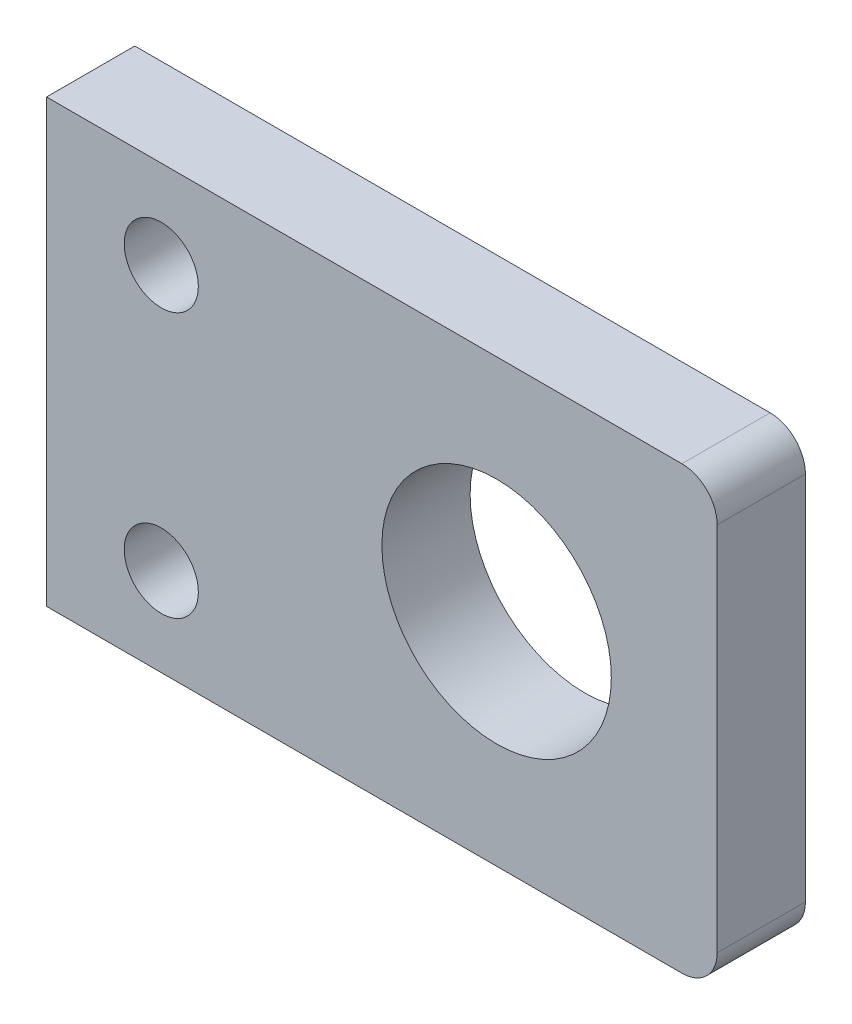
ISO-10303-21;
HEADER;
FILE_DESCRIPTION(('STEP AP214'),'2;1');
FILE_NAME('part.step','',(''),(''),'','','');
FILE_SCHEMA(('AUTOMOTIVE_DESIGN { 1 0 10303 214 1 1 1 1 }'));
ENDSEC;
DATA;
#1=APPLICATION_CONTEXT('core data for automotive mechanical design processes');
#2=APPLICATION_PROTOCOL_DEFINITION('international standard','automotive_design',2000,#1);
#3=PRODUCT_CONTEXT('',#1,'mechanical');
#4=PRODUCT('Part','Part','',(#3));
#5=PRODUCT_RELATED_PRODUCT_CATEGORY('part','',(#4));
#6=PRODUCT_DEFINITION_FORMATION('','',#4);
#7=PRODUCT_DEFINITION_CONTEXT('part definition',#1,'design');
#8=PRODUCT_DEFINITION('design','',#6,#7);
#9=PRODUCT_DEFINITION_SHAPE('','',#8);
#10=(LENGTH_UNIT() NAMED_UNIT(*) SI_UNIT(.MILLI.,.METRE.));
#11=(NAMED_UNIT(*) PLANE_ANGLE_UNIT() SI_UNIT($,.RADIAN.));
#12=(NAMED_UNIT(*) SI_UNIT($,.STERADIAN.) SOLID_ANGLE_UNIT());
#13=UNCERTAINTY_MEASURE_WITH_UNIT(LENGTH_MEASURE(1.E-05),#10,'distance_accuracy_value','');
#14=(GEOMETRIC_REPRESENTATION_CONTEXT(3) GLOBAL_UNCERTAINTY_ASSIGNED_CONTEXT((#13)) GLOBAL_UNIT_ASSIGNED_CONTEXT((#10,
#11,#12)) REPRESENTATION_CONTEXT('',''));
#15=CARTESIAN_POINT('',(0.,0.,0.));
#16=DIRECTION('',(0.,0.,1.));
#17=DIRECTION('',(1.,0.,0.));
#18=AXIS2_PLACEMENT_3D('',#15,#16,#17);
#19=CARTESIAN_POINT('',(19.4844559585492,14.4183937823834,5.));
#20=DIRECTION('',(0.,0.,-1.));
#21=DIRECTION('',(-1.,0.,0.));
#22=AXIS2_PLACEMENT_3D('',#19,#20,#21);
#23=CYLINDRICAL_SURFACE('',#22,2.);
#24=CARTESIAN_POINT('',(19.4844559585492,14.4183937823834,0.));
#25=DIRECTION('',(0.,0.,1.));
#26=DIRECTION('',(1.,0.,0.));
#27=AXIS2_PLACEMENT_3D('',#24,#25,#26);
#28=CIRCLE('',#27,2.);
#29=CARTESIAN_POINT('',(19.4844559585492,16.4183937823834,0.));
#30=VERTEX_POINT('',#29);
#31=CARTESIAN_POINT('',(21.4844559585492,14.4183937823834,0.));
#32=VERTEX_POINT('',#31);
#33=EDGE_CURVE('E135',#30,#32,#28,.F.);
#34=ORIENTED_EDGE('',*,*,#33,.F.);
#35=DIRECTION('',(0.,0.,-1.));
#36=VECTOR('',#35,1.);
#37=CARTESIAN_POINT('',(19.4844559585492,16.4183937823834,5.));
#38=LINE('',#37,#36);
#39=CARTESIAN_POINT('',(19.4844559585492,16.4183937823834,5.));
#40=VERTEX_POINT('',#39);
#41=EDGE_CURVE('E11',#40,#30,#38,.T.);
#42=ORIENTED_EDGE('',*,*,#41,.F.);
#43=CARTESIAN_POINT('',(19.4844559585492,14.4183937823834,5.));
#44=DIRECTION('',(0.,0.,1.));
#45=DIRECTION('',(1.,0.,0.));
#46=AXIS2_PLACEMENT_3D('',#43,#44,#45);
#47=CIRCLE('',#46,2.);
#48=CARTESIAN_POINT('',(21.4844559585492,14.4183937823834,5.));
#49=VERTEX_POINT('',#48);
#50=EDGE_CURVE('E157',#40,#49,#47,.F.);
#51=ORIENTED_EDGE('',*,*,#50,.T.);
#52=DIRECTION('',(0.,0.,-1.));
#53=VECTOR('',#52,1.);
#54=CARTESIAN_POINT('',(21.4844559585492,14.4183937823834,5.));
#55=LINE('',#54,#53);
#56=EDGE_CURVE('E59',#49,#32,#55,.T.);
#57=ORIENTED_EDGE('',*,*,#56,.T.);
#58=EDGE_LOOP('',(#34,#42,#51,#57));
#59=FACE_BOUND('',#58,.T.);
#60=ADVANCED_FACE('F43',(#59),#23,.T.);
#61=CARTESIAN_POINT('',(0.,16.4183937823834,5.));
#62=DIRECTION('',(0.,1.,0.));
#63=DIRECTION('',(0.,0.,1.));
#64=AXIS2_PLACEMENT_3D('',#61,#62,#63);
#65=PLANE('',#64);
#66=DIRECTION('',(1.,0.,0.));
#67=VECTOR('',#66,1.);
#68=CARTESIAN_POINT('',(0.,16.4183937823834,0.));
#69=LINE('',#68,#67);
#70=CARTESIAN_POINT('',(-16.5155440414508,16.4183937823834,0.));
#71=VERTEX_POINT('',#70);
#72=EDGE_CURVE('E137',#71,#30,#69,.T.);
#73=ORIENTED_EDGE('',*,*,#72,.F.);
#74=DIRECTION('',(0.,0.,-1.));
#75=VECTOR('',#74,1.);
#76=CARTESIAN_POINT('',(-16.5155440414508,16.4183937823834,5.));
#77=LINE('',#76,#75);
#78=CARTESIAN_POINT('',(-16.5155440414508,16.4183937823834,5.));
#79=VERTEX_POINT('',#78);
#80=EDGE_CURVE('E51',#79,#71,#77,.T.);
#81=ORIENTED_EDGE('',*,*,#80,.F.);
#82=DIRECTION('',(1.,0.,0.));
#83=VECTOR('',#82,1.);
#84=CARTESIAN_POINT('',(0.,16.4183937823834,5.));
#85=LINE('',#84,#83);
#86=EDGE_CURVE('E170',#79,#40,#85,.T.);
#87=ORIENTED_EDGE('',*,*,#86,.T.);
#88=ORIENTED_EDGE('',*,*,#41,.T.);
#89=EDGE_LOOP('',(#73,#81,#87,#88));
#90=FACE_BOUND('',#89,.T.);
#91=ADVANCED_FACE('F169',(#90),#65,.T.);
#92=CARTESIAN_POINT('',(-16.5155440414508,0.,5.));
#93=DIRECTION('',(1.,0.,0.));
#94=DIRECTION('',(0.,0.,-1.));
#95=AXIS2_PLACEMENT_3D('',#92,#93,#94);
#96=PLANE('',#95);
#97=DIRECTION('',(0.,-1.,0.));
#98=VECTOR('',#97,1.);
#99=CARTESIAN_POINT('',(-16.5155440414508,0.,0.));
#100=LINE('',#99,#98);
#101=CARTESIAN_POINT('',(-16.5155440414508,-8.58160621761658,0.));
#102=VERTEX_POINT('',#101);
#103=EDGE_CURVE('E140',#71,#102,#100,.T.);
#104=ORIENTED_EDGE('',*,*,#103,.T.);
#105=DIRECTION('',(0.,0.,-1.));
#106=VECTOR('',#105,1.);
#107=CARTESIAN_POINT('',(-16.5155440414508,-8.58160621761658,5.));
#108=LINE('',#107,#106);
#109=CARTESIAN_POINT('',(-16.5155440414508,-8.58160621761658,5.));
#110=VERTEX_POINT('',#109);
#111=EDGE_CURVE('E118',#110,#102,#108,.T.);
#112=ORIENTED_EDGE('',*,*,#111,.F.);
#113=DIRECTION('',(0.,-1.,0.));
#114=VECTOR('',#113,1.);
#115=CARTESIAN_POINT('',(-16.5155440414508,0.,5.));
#116=LINE('',#115,#114);
#117=EDGE_CURVE('E106',#79,#110,#116,.T.);
#118=ORIENTED_EDGE('',*,*,#117,.F.);
#119=ORIENTED_EDGE('',*,*,#80,.T.);
#120=EDGE_LOOP('',(#104,#112,#118,#119));
#121=FACE_BOUND('',#120,.T.);
#122=ADVANCED_FACE('F162',(#121),#96,.F.);
#123=CARTESIAN_POINT('',(0.,-8.58160621761658,5.));
#124=DIRECTION('',(0.,1.,0.));
#125=DIRECTION('',(0.,0.,1.));
#126=AXIS2_PLACEMENT_3D('',#123,#124,#125);
#127=PLANE('',#126);
#128=DIRECTION('',(1.,0.,0.));
#129=VECTOR('',#128,1.);
#130=CARTESIAN_POINT('',(0.,-8.58160621761658,0.));
#131=LINE('',#130,#129);
#132=CARTESIAN_POINT('',(19.4844559585492,-8.58160621761658,0.));
#133=VERTEX_POINT('',#132);
#134=EDGE_CURVE('E115',#102,#133,#131,.T.);
#135=ORIENTED_EDGE('',*,*,#134,.T.);
#136=DIRECTION('',(0.,0.,-1.));
#137=VECTOR('',#136,1.);
#138=CARTESIAN_POINT('',(19.4844559585492,-8.58160621761658,5.));
#139=LINE('',#138,#137);
#140=CARTESIAN_POINT('',(19.4844559585492,-8.58160621761658,5.));
#141=VERTEX_POINT('',#140);
#142=EDGE_CURVE('E112',#141,#133,#139,.T.);
#143=ORIENTED_EDGE('',*,*,#142,.F.);
#144=DIRECTION('',(1.,0.,0.));
#145=VECTOR('',#144,1.);
#146=CARTESIAN_POINT('',(0.,-8.58160621761658,5.));
#147=LINE('',#146,#145);
#148=EDGE_CURVE('E97',#110,#141,#147,.T.);
#149=ORIENTED_EDGE('',*,*,#148,.F.);
#150=ORIENTED_EDGE('',*,*,#111,.T.);
#151=EDGE_LOOP('',(#135,#143,#149,#150));
#152=FACE_BOUND('',#151,.T.);
#153=ADVANCED_FACE('F113',(#152),#127,.F.);
#154=CARTESIAN_POINT('',(19.4844559585492,-6.58160621761658,5.));
#155=DIRECTION('',(0.,0.,-1.));
#156=DIRECTION('',(-1.,0.,0.));
#157=AXIS2_PLACEMENT_3D('',#154,#155,#156);
#158=CYLINDRICAL_SURFACE('',#157,2.);
#159=CARTESIAN_POINT('',(19.4844559585492,-6.58160621761658,0.));
#160=DIRECTION('',(0.,0.,1.));
#161=DIRECTION('',(1.,0.,0.));
#162=AXIS2_PLACEMENT_3D('',#159,#160,#161);
#163=CIRCLE('',#162,2.);
#164=CARTESIAN_POINT('',(21.4844559585492,-6.58160621761657,0.));
#165=VERTEX_POINT('',#164);
#166=EDGE_CURVE('E143',#133,#165,#163,.T.);
#167=ORIENTED_EDGE('',*,*,#166,.T.);
#168=DIRECTION('',(0.,0.,-1.));
#169=VECTOR('',#168,1.);
#170=CARTESIAN_POINT('',(21.4844559585492,-6.58160621761657,5.));
#171=LINE('',#170,#169);
#172=CARTESIAN_POINT('',(21.4844559585492,-6.58160621761657,5.));
#173=VERTEX_POINT('',#172);
#174=EDGE_CURVE('E79',#173,#165,#171,.T.);
#175=ORIENTED_EDGE('',*,*,#174,.F.);
#176=CARTESIAN_POINT('',(19.4844559585492,-6.58160621761658,5.));
#177=DIRECTION('',(0.,0.,1.));
#178=DIRECTION('',(1.,0.,0.));
#179=AXIS2_PLACEMENT_3D('',#176,#177,#178);
#180=CIRCLE('',#179,2.);
#181=EDGE_CURVE('E103',#141,#173,#180,.T.);
#182=ORIENTED_EDGE('',*,*,#181,.F.);
#183=ORIENTED_EDGE('',*,*,#142,.T.);
#184=EDGE_LOOP('',(#167,#175,#182,#183));
#185=FACE_BOUND('',#184,.T.);
#186=ADVANCED_FACE('F120',(#185),#158,.T.);
#187=CARTESIAN_POINT('',(-10.0155440414508,11.4183937823834,5.));
#188=DIRECTION('',(0.,0.,-1.));
#189=DIRECTION('',(-1.,0.,0.));
#190=AXIS2_PLACEMENT_3D('',#187,#188,#189);
#191=CYLINDRICAL_SURFACE('',#190,2.1);
#192=CARTESIAN_POINT('',(-10.0155440414508,11.4183937823834,5.));
#193=DIRECTION('',(0.,0.,1.));
#194=DIRECTION('',(1.,0.,0.));
#195=AXIS2_PLACEMENT_3D('',#192,#193,#194);
#196=CIRCLE('',#195,2.1);
#197=CARTESIAN_POINT('',(-7.91554404145077,11.4183937823834,5.));
#198=VERTEX_POINT('',#197);
#199=EDGE_CURVE('E129',#198,#198,#196,.T.);
#200=ORIENTED_EDGE('',*,*,#199,.T.);
#201=EDGE_LOOP('',(#200));
#202=FACE_BOUND('',#201,.T.);
#203=CARTESIAN_POINT('',(-10.0155440414508,11.4183937823834,0.));
#204=DIRECTION('',(0.,0.,1.));
#205=DIRECTION('',(1.,0.,0.));
#206=AXIS2_PLACEMENT_3D('',#203,#204,#205);
#207=CIRCLE('',#206,2.1);
#208=CARTESIAN_POINT('',(-7.91554404145077,11.4183937823834,0.));
#209=VERTEX_POINT('',#208);
#210=EDGE_CURVE('E151',#209,#209,#207,.T.);
#211=ORIENTED_EDGE('',*,*,#210,.F.);
#212=EDGE_LOOP('',(#211));
#213=FACE_BOUND('',#212,.T.);
#214=ADVANCED_FACE('F182',(#202,#213),#191,.F.);
#215=CARTESIAN_POINT('',(8.98445595854922,3.91839378238342,5.));
#216=DIRECTION('',(0.,0.,-1.));
#217=DIRECTION('',(-1.,0.,0.));
#218=AXIS2_PLACEMENT_3D('',#215,#216,#217);
#219=CYLINDRICAL_SURFACE('',#218,6.5);
#220=CARTESIAN_POINT('',(8.98445595854922,3.91839378238342,5.));
#221=DIRECTION('',(0.,0.,1.));
#222=DIRECTION('',(1.,0.,0.));
#223=AXIS2_PLACEMENT_3D('',#220,#221,#222);
#224=CIRCLE('',#223,6.5);
#225=CARTESIAN_POINT('',(15.4844559585492,3.91839378238342,5.));
#226=VERTEX_POINT('',#225);
#227=EDGE_CURVE('E123',#226,#226,#224,.T.);
#228=ORIENTED_EDGE('',*,*,#227,.T.);
#229=EDGE_LOOP('',(#228));
#230=FACE_BOUND('',#229,.T.);
#231=CARTESIAN_POINT('',(8.98445595854922,3.91839378238342,0.));
#232=DIRECTION('',(0.,0.,1.));
#233=DIRECTION('',(1.,0.,0.));
#234=AXIS2_PLACEMENT_3D('',#231,#232,#233);
#235=CIRCLE('',#234,6.5);
#236=CARTESIAN_POINT('',(15.4844559585492,3.91839378238342,0.));
#237=VERTEX_POINT('',#236);
#238=EDGE_CURVE('E148',#237,#237,#235,.T.);
#239=ORIENTED_EDGE('',*,*,#238,.F.);
#240=EDGE_LOOP('',(#239));
#241=FACE_BOUND('',#240,.T.);
#242=ADVANCED_FACE('F174',(#230,#241),#219,.F.);
#243=CARTESIAN_POINT('',(21.4844559585492,0.,5.));
#244=DIRECTION('',(1.,0.,0.));
#245=DIRECTION('',(0.,0.,-1.));
#246=AXIS2_PLACEMENT_3D('',#243,#244,#245);
#247=PLANE('',#246);
#248=DIRECTION('',(0.,-1.,0.));
#249=VECTOR('',#248,1.);
#250=CARTESIAN_POINT('',(21.4844559585492,0.,0.));
#251=LINE('',#250,#249);
#252=EDGE_CURVE('E145',#32,#165,#251,.T.);
#253=ORIENTED_EDGE('',*,*,#252,.F.);
#254=ORIENTED_EDGE('',*,*,#56,.F.);
#255=DIRECTION('',(0.,-1.,0.));
#256=VECTOR('',#255,1.);
#257=CARTESIAN_POINT('',(21.4844559585492,0.,5.));
#258=LINE('',#257,#256);
#259=EDGE_CURVE('E121',#49,#173,#258,.T.);
#260=ORIENTED_EDGE('',*,*,#259,.T.);
#261=ORIENTED_EDGE('',*,*,#174,.T.);
#262=EDGE_LOOP('',(#253,#254,#260,#261));
#263=FACE_BOUND('',#262,.T.);
#264=ADVANCED_FACE('F171',(#263),#247,.T.);
#265=CARTESIAN_POINT('',(-10.0155440414508,-3.58160621761658,5.));
#266=DIRECTION('',(0.,0.,-1.));
#267=DIRECTION('',(-1.,0.,0.));
#268=AXIS2_PLACEMENT_3D('',#265,#266,#267);
#269=CYLINDRICAL_SURFACE('',#268,2.1);
#270=CARTESIAN_POINT('',(-10.0155440414508,-3.58160621761658,5.));
#271=DIRECTION('',(0.,0.,1.));
#272=DIRECTION('',(1.,0.,0.));
#273=AXIS2_PLACEMENT_3D('',#270,#271,#272);
#274=CIRCLE('',#273,2.1);
#275=CARTESIAN_POINT('',(-7.91554404145077,-3.58160621761658,5.));
#276=VERTEX_POINT('',#275);
#277=EDGE_CURVE('E132',#276,#276,#274,.T.);
#278=ORIENTED_EDGE('',*,*,#277,.T.);
#279=EDGE_LOOP('',(#278));
#280=FACE_BOUND('',#279,.T.);
#281=CARTESIAN_POINT('',(-10.0155440414508,-3.58160621761658,0.));
#282=DIRECTION('',(0.,0.,1.));
#283=DIRECTION('',(1.,0.,0.));
#284=AXIS2_PLACEMENT_3D('',#281,#282,#283);
#285=CIRCLE('',#284,2.1);
#286=CARTESIAN_POINT('',(-7.91554404145077,-3.58160621761658,0.));
#287=VERTEX_POINT('',#286);
#288=EDGE_CURVE('E154',#287,#287,#285,.T.);
#289=ORIENTED_EDGE('',*,*,#288,.F.);
#290=EDGE_LOOP('',(#289));
#291=FACE_BOUND('',#290,.T.);
#292=ADVANCED_FACE('F173',(#280,#291),#269,.F.);
#293=CARTESIAN_POINT('',(0.,0.,5.));
#294=DIRECTION('',(0.,0.,1.));
#295=DIRECTION('',(1.,0.,0.));
#296=AXIS2_PLACEMENT_3D('',#293,#294,#295);
#297=PLANE('',#296);
#298=ORIENTED_EDGE('',*,*,#50,.F.);
#299=ORIENTED_EDGE('',*,*,#86,.F.);
#300=ORIENTED_EDGE('',*,*,#117,.T.);
#301=ORIENTED_EDGE('',*,*,#148,.T.);
#302=ORIENTED_EDGE('',*,*,#181,.T.);
#303=ORIENTED_EDGE('',*,*,#259,.F.);
#304=EDGE_LOOP('',(#298,#299,#300,#301,#302,#303));
#305=FACE_BOUND('',#304,.T.);
#306=ORIENTED_EDGE('',*,*,#227,.F.);
#307=EDGE_LOOP('',(#306));
#308=FACE_BOUND('',#307,.T.);
#309=ORIENTED_EDGE('',*,*,#199,.F.);
#310=EDGE_LOOP('',(#309));
#311=FACE_BOUND('',#310,.T.);
#312=ORIENTED_EDGE('',*,*,#277,.F.);
#313=EDGE_LOOP('',(#312));
#314=FACE_BOUND('',#313,.T.);
#315=ADVANCED_FACE('F99',(#305,#308,#311,#314),#297,.T.);
#316=CARTESIAN_POINT('',(0.,0.,0.));
#317=DIRECTION('',(0.,0.,1.));
#318=DIRECTION('',(1.,0.,0.));
#319=AXIS2_PLACEMENT_3D('',#316,#317,#318);
#320=PLANE('',#319);
#321=ORIENTED_EDGE('',*,*,#33,.T.);
#322=ORIENTED_EDGE('',*,*,#252,.T.);
#323=ORIENTED_EDGE('',*,*,#166,.F.);
#324=ORIENTED_EDGE('',*,*,#134,.F.);
#325=ORIENTED_EDGE('',*,*,#103,.F.);
#326=ORIENTED_EDGE('',*,*,#72,.T.);
#327=EDGE_LOOP('',(#321,#322,#323,#324,#325,#326));
#328=FACE_BOUND('',#327,.T.);
#329=ORIENTED_EDGE('',*,*,#238,.T.);
#330=EDGE_LOOP('',(#329));
#331=FACE_BOUND('',#330,.T.);
#332=ORIENTED_EDGE('',*,*,#210,.T.);
#333=EDGE_LOOP('',(#332));
#334=FACE_BOUND('',#333,.T.);
#335=ORIENTED_EDGE('',*,*,#288,.T.);
#336=EDGE_LOOP('',(#335));
#337=FACE_BOUND('',#336,.T.);
#338=ADVANCED_FACE('F167',(#328,#331,#334,#337),#320,.F.);
#339=CLOSED_SHELL('',(#60,#91,#122,#153,#186,#214,#242,#264,#292,#315,#338));
#340=MANIFOLD_SOLID_BREP('B2',#339);
#341=ADVANCED_BREP_SHAPE_REPRESENTATION('',(#18,#340),#14);
#342=SHAPE_DEFINITION_REPRESENTATION(#9,#341);
ENDSEC;
END-ISO-10303-21;
